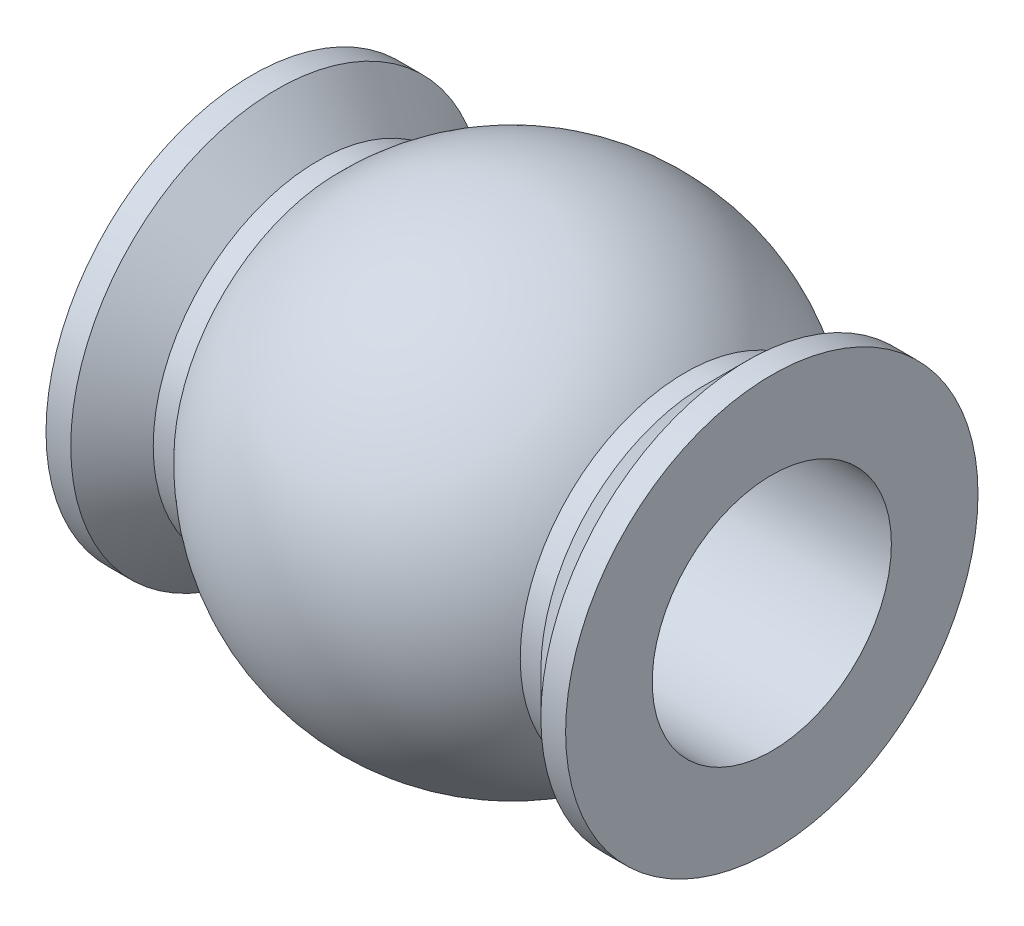
ISO-10303-21;
HEADER;
FILE_DESCRIPTION(('STEP AP214'),'2;1');
FILE_NAME('part.step','',(''),(''),'','','');
FILE_SCHEMA(('AUTOMOTIVE_DESIGN { 1 0 10303 214 1 1 1 1 }'));
ENDSEC;
DATA;
#1=APPLICATION_CONTEXT('core data for automotive mechanical design processes');
#2=APPLICATION_PROTOCOL_DEFINITION('international standard','automotive_design',2000,#1);
#3=PRODUCT_CONTEXT('',#1,'mechanical');
#4=PRODUCT('Part','Part','',(#3));
#5=PRODUCT_RELATED_PRODUCT_CATEGORY('part','',(#4));
#6=PRODUCT_DEFINITION_FORMATION('','',#4);
#7=PRODUCT_DEFINITION_CONTEXT('part definition',#1,'design');
#8=PRODUCT_DEFINITION('design','',#6,#7);
#9=PRODUCT_DEFINITION_SHAPE('','',#8);
#10=(LENGTH_UNIT() NAMED_UNIT(*) SI_UNIT(.MILLI.,.METRE.));
#11=(NAMED_UNIT(*) PLANE_ANGLE_UNIT() SI_UNIT($,.RADIAN.));
#12=(NAMED_UNIT(*) SI_UNIT($,.STERADIAN.) SOLID_ANGLE_UNIT());
#13=UNCERTAINTY_MEASURE_WITH_UNIT(LENGTH_MEASURE(1.E-05),#10,'distance_accuracy_value','');
#14=(GEOMETRIC_REPRESENTATION_CONTEXT(3) GLOBAL_UNCERTAINTY_ASSIGNED_CONTEXT((#13)) GLOBAL_UNIT_ASSIGNED_CONTEXT((#10,
#11,#12)) REPRESENTATION_CONTEXT('',''));
#15=CARTESIAN_POINT('',(0.,0.,0.));
#16=DIRECTION('',(0.,0.,1.));
#17=DIRECTION('',(1.,0.,0.));
#18=AXIS2_PLACEMENT_3D('',#15,#16,#17);
#19=CARTESIAN_POINT('',(3.15,0.,0.));
#20=DIRECTION('',(-1.,0.,0.));
#21=DIRECTION('',(0.,0.,1.));
#22=AXIS2_PLACEMENT_3D('',#19,#20,#21);
#23=CYLINDRICAL_SURFACE('',#22,2.);
#24=CARTESIAN_POINT('',(-2.1,0.,0.));
#25=DIRECTION('',(1.,0.,0.));
#26=DIRECTION('',(0.,0.,-1.));
#27=AXIS2_PLACEMENT_3D('',#24,#25,#26);
#28=CIRCLE('',#27,2.);
#29=CARTESIAN_POINT('',(-2.1,0.,-2.));
#30=VERTEX_POINT('',#29);
#31=EDGE_CURVE('E25',#30,#30,#28,.F.);
#32=ORIENTED_EDGE('',*,*,#31,.T.);
#33=EDGE_LOOP('',(#32));
#34=FACE_BOUND('',#33,.T.);
#35=CARTESIAN_POINT('',(-2.35,0.,0.));
#36=DIRECTION('',(-1.,0.,0.));
#37=DIRECTION('',(0.,0.,1.));
#38=AXIS2_PLACEMENT_3D('',#35,#36,#37);
#39=CIRCLE('',#38,2.);
#40=CARTESIAN_POINT('',(-2.35,0.,2.));
#41=VERTEX_POINT('',#40);
#42=EDGE_CURVE('E10',#41,#41,#39,.T.);
#43=ORIENTED_EDGE('',*,*,#42,.F.);
#44=EDGE_LOOP('',(#43));
#45=FACE_BOUND('',#44,.T.);
#46=ADVANCED_FACE('F14',(#34,#45),#23,.T.);
#47=CARTESIAN_POINT('',(2.1,0.,0.));
#48=DIRECTION('',(-1.,0.,0.));
#49=DIRECTION('',(0.,0.,1.));
#50=AXIS2_PLACEMENT_3D('',#47,#48,#49);
#51=CIRCLE('',#50,2.);
#52=CARTESIAN_POINT('',(2.1,0.,2.));
#53=VERTEX_POINT('',#52);
#54=EDGE_CURVE('E29',#53,#53,#51,.F.);
#55=ORIENTED_EDGE('',*,*,#54,.T.);
#56=EDGE_LOOP('',(#55));
#57=FACE_BOUND('',#56,.T.);
#58=CARTESIAN_POINT('',(2.35,0.,0.));
#59=DIRECTION('',(1.,0.,0.));
#60=DIRECTION('',(0.,0.,-1.));
#61=AXIS2_PLACEMENT_3D('',#58,#59,#60);
#62=CIRCLE('',#61,2.);
#63=CARTESIAN_POINT('',(2.35,0.,-2.));
#64=VERTEX_POINT('',#63);
#65=EDGE_CURVE('E21',#64,#64,#62,.T.);
#66=ORIENTED_EDGE('',*,*,#65,.F.);
#67=EDGE_LOOP('',(#66));
#68=FACE_BOUND('',#67,.T.);
#69=ADVANCED_FACE('F73',(#57,#68),#23,.T.);
#70=CARTESIAN_POINT('',(0.,0.,0.));
#71=DIRECTION('',(-1.,0.,0.));
#72=DIRECTION('',(0.,1.,0.));
#73=AXIS2_PLACEMENT_3D('',#70,#71,#72);
#74=SPHERICAL_SURFACE('',#73,2.9);
#75=ORIENTED_EDGE('',*,*,#54,.F.);
#76=EDGE_LOOP('',(#75));
#77=FACE_BOUND('',#76,.T.);
#78=ORIENTED_EDGE('',*,*,#31,.F.);
#79=EDGE_LOOP('',(#78));
#80=FACE_BOUND('',#79,.T.);
#81=ADVANCED_FACE('F16',(#77,#80),#74,.T.);
#82=CARTESIAN_POINT('',(0.,0.,0.));
#83=DIRECTION('',(-1.,0.,0.));
#84=DIRECTION('',(0.,0.,1.));
#85=AXIS2_PLACEMENT_3D('',#82,#83,#84);
#86=CYLINDRICAL_SURFACE('',#85,2.5);
#87=CARTESIAN_POINT('',(2.85,0.,0.));
#88=DIRECTION('',(-1.,0.,0.));
#89=DIRECTION('',(0.,0.,1.));
#90=AXIS2_PLACEMENT_3D('',#87,#88,#89);
#91=CIRCLE('',#90,2.5);
#92=CARTESIAN_POINT('',(2.85,0.,2.5));
#93=VERTEX_POINT('',#92);
#94=EDGE_CURVE('E37',#93,#93,#91,.T.);
#95=ORIENTED_EDGE('',*,*,#94,.F.);
#96=EDGE_LOOP('',(#95));
#97=FACE_BOUND('',#96,.T.);
#98=CARTESIAN_POINT('',(3.15,0.,0.));
#99=DIRECTION('',(-1.,0.,0.));
#100=DIRECTION('',(0.,0.,1.));
#101=AXIS2_PLACEMENT_3D('',#98,#99,#100);
#102=CIRCLE('',#101,2.5);
#103=CARTESIAN_POINT('',(3.15,0.,2.5));
#104=VERTEX_POINT('',#103);
#105=EDGE_CURVE('E34',#104,#104,#102,.T.);
#106=ORIENTED_EDGE('',*,*,#105,.T.);
#107=EDGE_LOOP('',(#106));
#108=FACE_BOUND('',#107,.T.);
#109=ADVANCED_FACE('F63',(#97,#108),#86,.T.);
#110=CARTESIAN_POINT('',(2.85,0.,0.));
#111=DIRECTION('',(1.,0.,0.));
#112=DIRECTION('',(0.,0.,-1.));
#113=AXIS2_PLACEMENT_3D('',#110,#111,#112);
#114=CONICAL_SURFACE('',#113,2.5,0.785398163397443);
#115=ORIENTED_EDGE('',*,*,#65,.T.);
#116=EDGE_LOOP('',(#115));
#117=FACE_BOUND('',#116,.T.);
#118=ORIENTED_EDGE('',*,*,#94,.T.);
#119=EDGE_LOOP('',(#118));
#120=FACE_BOUND('',#119,.T.);
#121=ADVANCED_FACE('F59',(#117,#120),#114,.T.);
#122=CARTESIAN_POINT('',(3.15,0.,0.));
#123=DIRECTION('',(1.,0.,0.));
#124=DIRECTION('',(0.,0.,-1.));
#125=AXIS2_PLACEMENT_3D('',#122,#123,#124);
#126=PLANE('',#125);
#127=CARTESIAN_POINT('',(3.15,0.,0.));
#128=DIRECTION('',(1.,0.,0.));
#129=DIRECTION('',(0.,0.,-1.));
#130=AXIS2_PLACEMENT_3D('',#127,#128,#129);
#131=CIRCLE('',#130,1.44999999999999);
#132=CARTESIAN_POINT('',(3.15,0.,-1.44999999999999));
#133=VERTEX_POINT('',#132);
#134=EDGE_CURVE('E49',#133,#133,#131,.T.);
#135=ORIENTED_EDGE('',*,*,#134,.F.);
#136=EDGE_LOOP('',(#135));
#137=FACE_BOUND('',#136,.T.);
#138=ORIENTED_EDGE('',*,*,#105,.F.);
#139=EDGE_LOOP('',(#138));
#140=FACE_BOUND('',#139,.T.);
#141=ADVANCED_FACE('F55',(#137,#140),#126,.T.);
#142=CARTESIAN_POINT('',(0.,0.,0.));
#143=DIRECTION('',(1.,0.,0.));
#144=DIRECTION('',(0.,0.,1.));
#145=AXIS2_PLACEMENT_3D('',#142,#143,#144);
#146=CYLINDRICAL_SURFACE('',#145,2.5);
#147=CARTESIAN_POINT('',(-2.85,0.,0.));
#148=DIRECTION('',(-1.,0.,0.));
#149=DIRECTION('',(0.,0.,1.));
#150=AXIS2_PLACEMENT_3D('',#147,#148,#149);
#151=CIRCLE('',#150,2.5);
#152=CARTESIAN_POINT('',(-2.85,0.,2.5));
#153=VERTEX_POINT('',#152);
#154=EDGE_CURVE('E43',#153,#153,#151,.T.);
#155=ORIENTED_EDGE('',*,*,#154,.T.);
#156=EDGE_LOOP('',(#155));
#157=FACE_BOUND('',#156,.T.);
#158=CARTESIAN_POINT('',(-3.15,0.,0.));
#159=DIRECTION('',(-1.,0.,0.));
#160=DIRECTION('',(0.,0.,1.));
#161=AXIS2_PLACEMENT_3D('',#158,#159,#160);
#162=CIRCLE('',#161,2.5);
#163=CARTESIAN_POINT('',(-3.15,0.,2.5));
#164=VERTEX_POINT('',#163);
#165=EDGE_CURVE('E40',#164,#164,#162,.T.);
#166=ORIENTED_EDGE('',*,*,#165,.F.);
#167=EDGE_LOOP('',(#166));
#168=FACE_BOUND('',#167,.T.);
#169=ADVANCED_FACE('F58',(#157,#168),#146,.T.);
#170=CARTESIAN_POINT('',(-2.85,0.,0.));
#171=DIRECTION('',(-1.,0.,0.));
#172=DIRECTION('',(0.,0.,-1.));
#173=AXIS2_PLACEMENT_3D('',#170,#171,#172);
#174=CONICAL_SURFACE('',#173,2.5,0.785398163397443);
#175=ORIENTED_EDGE('',*,*,#42,.T.);
#176=EDGE_LOOP('',(#175));
#177=FACE_BOUND('',#176,.T.);
#178=ORIENTED_EDGE('',*,*,#154,.F.);
#179=EDGE_LOOP('',(#178));
#180=FACE_BOUND('',#179,.T.);
#181=ADVANCED_FACE('F86',(#177,#180),#174,.T.);
#182=CARTESIAN_POINT('',(-3.15,0.,0.));
#183=DIRECTION('',(1.,0.,0.));
#184=DIRECTION('',(0.,0.,-1.));
#185=AXIS2_PLACEMENT_3D('',#182,#183,#184);
#186=PLANE('',#185);
#187=CARTESIAN_POINT('',(-3.15,0.,0.));
#188=DIRECTION('',(1.,0.,0.));
#189=DIRECTION('',(0.,0.,-1.));
#190=AXIS2_PLACEMENT_3D('',#187,#188,#189);
#191=CIRCLE('',#190,1.45);
#192=CARTESIAN_POINT('',(-3.15,0.,-1.45));
#193=VERTEX_POINT('',#192);
#194=EDGE_CURVE('E46',#193,#193,#191,.T.);
#195=ORIENTED_EDGE('',*,*,#194,.T.);
#196=EDGE_LOOP('',(#195));
#197=FACE_BOUND('',#196,.T.);
#198=ORIENTED_EDGE('',*,*,#165,.T.);
#199=EDGE_LOOP('',(#198));
#200=FACE_BOUND('',#199,.T.);
#201=ADVANCED_FACE('F84',(#197,#200),#186,.F.);
#202=CARTESIAN_POINT('',(3.15,0.,0.));
#203=DIRECTION('',(1.,0.,0.));
#204=DIRECTION('',(0.,0.,-1.));
#205=AXIS2_PLACEMENT_3D('',#202,#203,#204);
#206=CYLINDRICAL_SURFACE('',#205,1.45);
#207=ORIENTED_EDGE('',*,*,#194,.F.);
#208=EDGE_LOOP('',(#207));
#209=FACE_BOUND('',#208,.T.);
#210=ORIENTED_EDGE('',*,*,#134,.T.);
#211=EDGE_LOOP('',(#210));
#212=FACE_BOUND('',#211,.T.);
#213=ADVANCED_FACE('F53',(#209,#212),#206,.F.);
#214=CLOSED_SHELL('',(#46,#69,#81,#109,#121,#141,#169,#181,#201,#213));
#215=MANIFOLD_SOLID_BREP('B1',#214);
#216=ADVANCED_BREP_SHAPE_REPRESENTATION('',(#18,#215),#14);
#217=SHAPE_DEFINITION_REPRESENTATION(#9,#216);
ENDSEC;
END-ISO-10303-21;
